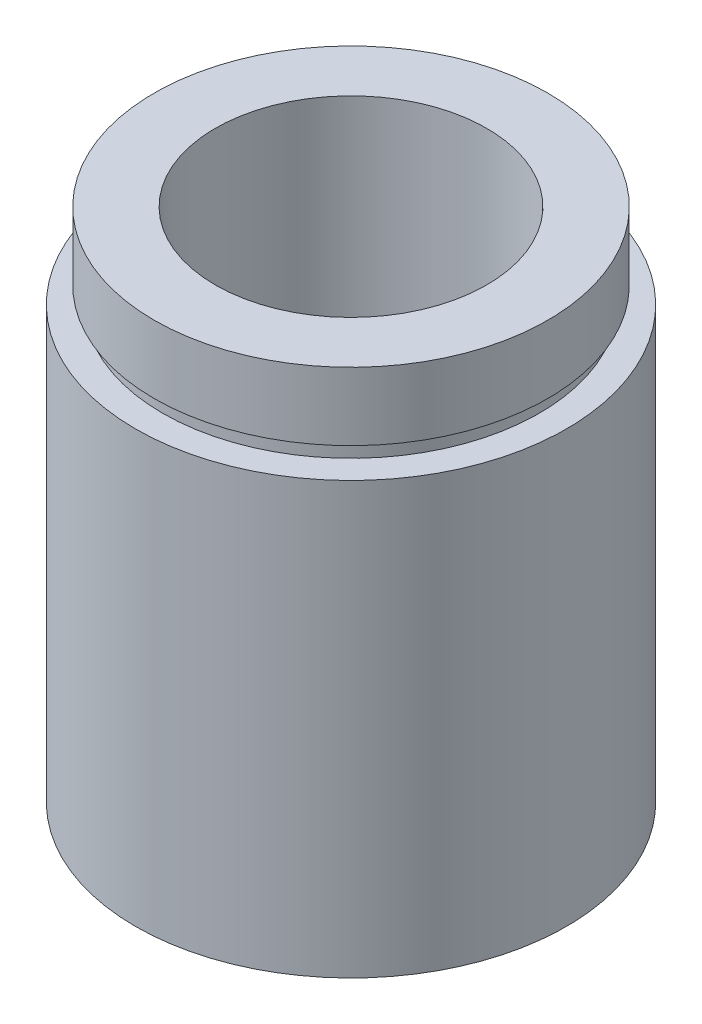
ISO-10303-21;
HEADER;
FILE_DESCRIPTION(('STEP AP214'),'2;1');
FILE_NAME('part.step','',(''),(''),'','','');
FILE_SCHEMA(('AUTOMOTIVE_DESIGN { 1 0 10303 214 1 1 1 1 }'));
ENDSEC;
DATA;
#1=APPLICATION_CONTEXT('core data for automotive mechanical design processes');
#2=APPLICATION_PROTOCOL_DEFINITION('international standard','automotive_design',2000,#1);
#3=PRODUCT_CONTEXT('',#1,'mechanical');
#4=PRODUCT('Part','Part','',(#3));
#5=PRODUCT_RELATED_PRODUCT_CATEGORY('part','',(#4));
#6=PRODUCT_DEFINITION_FORMATION('','',#4);
#7=PRODUCT_DEFINITION_CONTEXT('part definition',#1,'design');
#8=PRODUCT_DEFINITION('design','',#6,#7);
#9=PRODUCT_DEFINITION_SHAPE('','',#8);
#10=(LENGTH_UNIT() NAMED_UNIT(*) SI_UNIT(.MILLI.,.METRE.));
#11=(NAMED_UNIT(*) PLANE_ANGLE_UNIT() SI_UNIT($,.RADIAN.));
#12=(NAMED_UNIT(*) SI_UNIT($,.STERADIAN.) SOLID_ANGLE_UNIT());
#13=UNCERTAINTY_MEASURE_WITH_UNIT(LENGTH_MEASURE(1.E-05),#10,'distance_accuracy_value','');
#14=(GEOMETRIC_REPRESENTATION_CONTEXT(3) GLOBAL_UNCERTAINTY_ASSIGNED_CONTEXT((#13)) GLOBAL_UNIT_ASSIGNED_CONTEXT((#10,
#11,#12)) REPRESENTATION_CONTEXT('',''));
#15=CARTESIAN_POINT('',(0.,0.,0.));
#16=DIRECTION('',(0.,0.,1.));
#17=DIRECTION('',(1.,0.,0.));
#18=AXIS2_PLACEMENT_3D('',#15,#16,#17);
#19=CARTESIAN_POINT('',(11.1,0.,0.));
#20=DIRECTION('',(0.,1.,0.));
#21=DIRECTION('',(0.,0.,1.));
#22=AXIS2_PLACEMENT_3D('',#19,#20,#21);
#23=PLANE('',#22);
#24=CARTESIAN_POINT('',(0.,0.,0.));
#25=DIRECTION('',(0.,1.,0.));
#26=DIRECTION('',(0.,0.,1.));
#27=AXIS2_PLACEMENT_3D('',#24,#25,#26);
#28=CIRCLE('',#27,12.7);
#29=CARTESIAN_POINT('',(0.,0.,12.7));
#30=VERTEX_POINT('',#29);
#31=EDGE_CURVE('E10',#30,#30,#28,.T.);
#32=ORIENTED_EDGE('',*,*,#31,.F.);
#33=EDGE_LOOP('',(#32));
#34=FACE_BOUND('',#33,.T.);
#35=CARTESIAN_POINT('',(0.,0.,0.));
#36=DIRECTION('',(0.,1.,0.));
#37=DIRECTION('',(0.,0.,1.));
#38=AXIS2_PLACEMENT_3D('',#35,#36,#37);
#39=CIRCLE('',#38,11.1);
#40=CARTESIAN_POINT('',(0.,0.,11.1));
#41=VERTEX_POINT('',#40);
#42=EDGE_CURVE('E77',#41,#41,#39,.T.);
#43=ORIENTED_EDGE('',*,*,#42,.T.);
#44=EDGE_LOOP('',(#43));
#45=FACE_BOUND('',#44,.T.);
#46=ADVANCED_FACE('F37',(#34,#45),#23,.F.);
#47=CARTESIAN_POINT('',(0.,161.376166943427,0.));
#48=DIRECTION('',(0.,1.,0.));
#49=DIRECTION('',(0.,0.,1.));
#50=AXIS2_PLACEMENT_3D('',#47,#48,#49);
#51=CYLINDRICAL_SURFACE('',#50,12.7);
#52=CARTESIAN_POINT('',(0.,25.4,0.));
#53=DIRECTION('',(0.,1.,0.));
#54=DIRECTION('',(0.,0.,1.));
#55=AXIS2_PLACEMENT_3D('',#52,#53,#54);
#56=CIRCLE('',#55,12.7);
#57=CARTESIAN_POINT('',(0.,25.4,12.7));
#58=VERTEX_POINT('',#57);
#59=EDGE_CURVE('E43',#58,#58,#56,.T.);
#60=ORIENTED_EDGE('',*,*,#59,.F.);
#61=EDGE_LOOP('',(#60));
#62=FACE_BOUND('',#61,.T.);
#63=ORIENTED_EDGE('',*,*,#31,.T.);
#64=EDGE_LOOP('',(#63));
#65=FACE_BOUND('',#64,.T.);
#66=ADVANCED_FACE('F138',(#62,#65),#51,.T.);
#67=CARTESIAN_POINT('',(12.7,25.4,0.));
#68=DIRECTION('',(0.,-1.,0.));
#69=DIRECTION('',(0.,0.,-1.));
#70=AXIS2_PLACEMENT_3D('',#67,#68,#69);
#71=PLANE('',#70);
#72=CARTESIAN_POINT('',(0.,25.4,0.));
#73=DIRECTION('',(0.,1.,0.));
#74=DIRECTION('',(0.,0.,1.));
#75=AXIS2_PLACEMENT_3D('',#72,#73,#74);
#76=CIRCLE('',#75,11.1);
#77=CARTESIAN_POINT('',(0.,25.4,11.1));
#78=VERTEX_POINT('',#77);
#79=EDGE_CURVE('E47',#78,#78,#76,.T.);
#80=ORIENTED_EDGE('',*,*,#79,.F.);
#81=EDGE_LOOP('',(#80));
#82=FACE_BOUND('',#81,.T.);
#83=ORIENTED_EDGE('',*,*,#59,.T.);
#84=EDGE_LOOP('',(#83));
#85=FACE_BOUND('',#84,.T.);
#86=ADVANCED_FACE('F133',(#82,#85),#71,.F.);
#87=CARTESIAN_POINT('',(0.,161.376166943427,0.));
#88=DIRECTION('',(0.,1.,0.));
#89=DIRECTION('',(0.,0.,1.));
#90=AXIS2_PLACEMENT_3D('',#87,#88,#89);
#91=CYLINDRICAL_SURFACE('',#90,11.1);
#92=CARTESIAN_POINT('',(0.,26.4,0.));
#93=DIRECTION('',(0.,1.,0.));
#94=DIRECTION('',(0.,0.,1.));
#95=AXIS2_PLACEMENT_3D('',#92,#93,#94);
#96=CIRCLE('',#95,11.1);
#97=CARTESIAN_POINT('',(0.,26.4,11.1));
#98=VERTEX_POINT('',#97);
#99=EDGE_CURVE('E51',#98,#98,#96,.T.);
#100=ORIENTED_EDGE('',*,*,#99,.F.);
#101=EDGE_LOOP('',(#100));
#102=FACE_BOUND('',#101,.T.);
#103=ORIENTED_EDGE('',*,*,#79,.T.);
#104=EDGE_LOOP('',(#103));
#105=FACE_BOUND('',#104,.T.);
#106=ADVANCED_FACE('F127',(#102,#105),#91,.T.);
#107=CARTESIAN_POINT('',(11.1,26.4,0.));
#108=DIRECTION('',(0.,1.,0.));
#109=DIRECTION('',(0.,0.,1.));
#110=AXIS2_PLACEMENT_3D('',#107,#108,#109);
#111=PLANE('',#110);
#112=CARTESIAN_POINT('',(0.,26.4,0.));
#113=DIRECTION('',(0.,1.,0.));
#114=DIRECTION('',(0.,0.,1.));
#115=AXIS2_PLACEMENT_3D('',#112,#113,#114);
#116=CIRCLE('',#115,11.6);
#117=CARTESIAN_POINT('',(0.,26.4,11.6));
#118=VERTEX_POINT('',#117);
#119=EDGE_CURVE('E56',#118,#118,#116,.T.);
#120=ORIENTED_EDGE('',*,*,#119,.F.);
#121=EDGE_LOOP('',(#120));
#122=FACE_BOUND('',#121,.T.);
#123=ORIENTED_EDGE('',*,*,#99,.T.);
#124=EDGE_LOOP('',(#123));
#125=FACE_BOUND('',#124,.T.);
#126=ADVANCED_FACE('F121',(#122,#125),#111,.F.);
#127=CARTESIAN_POINT('',(0.,161.376166943427,0.));
#128=DIRECTION('',(0.,1.,0.));
#129=DIRECTION('',(0.,0.,1.));
#130=AXIS2_PLACEMENT_3D('',#127,#128,#129);
#131=CYLINDRICAL_SURFACE('',#130,11.6);
#132=CARTESIAN_POINT('',(0.,30.4,0.));
#133=DIRECTION('',(0.,1.,0.));
#134=DIRECTION('',(0.,0.,1.));
#135=AXIS2_PLACEMENT_3D('',#132,#133,#134);
#136=CIRCLE('',#135,11.6);
#137=CARTESIAN_POINT('',(0.,30.4,11.6));
#138=VERTEX_POINT('',#137);
#139=EDGE_CURVE('E59',#138,#138,#136,.T.);
#140=ORIENTED_EDGE('',*,*,#139,.F.);
#141=EDGE_LOOP('',(#140));
#142=FACE_BOUND('',#141,.T.);
#143=ORIENTED_EDGE('',*,*,#119,.T.);
#144=EDGE_LOOP('',(#143));
#145=FACE_BOUND('',#144,.T.);
#146=ADVANCED_FACE('F115',(#142,#145),#131,.T.);
#147=CARTESIAN_POINT('',(11.6,30.4,0.));
#148=DIRECTION('',(0.,-1.,0.));
#149=DIRECTION('',(0.,0.,-1.));
#150=AXIS2_PLACEMENT_3D('',#147,#148,#149);
#151=PLANE('',#150);
#152=CARTESIAN_POINT('',(0.,30.4,0.));
#153=DIRECTION('',(0.,1.,0.));
#154=DIRECTION('',(0.,0.,1.));
#155=AXIS2_PLACEMENT_3D('',#152,#153,#154);
#156=CIRCLE('',#155,8.00000000000002);
#157=CARTESIAN_POINT('',(0.,30.4,8.00000000000002));
#158=VERTEX_POINT('',#157);
#159=EDGE_CURVE('E62',#158,#158,#156,.T.);
#160=ORIENTED_EDGE('',*,*,#159,.F.);
#161=EDGE_LOOP('',(#160));
#162=FACE_BOUND('',#161,.T.);
#163=ORIENTED_EDGE('',*,*,#139,.T.);
#164=EDGE_LOOP('',(#163));
#165=FACE_BOUND('',#164,.T.);
#166=ADVANCED_FACE('F109',(#162,#165),#151,.F.);
#167=CARTESIAN_POINT('',(0.,161.376166943427,0.));
#168=DIRECTION('',(0.,1.,0.));
#169=DIRECTION('',(0.,0.,1.));
#170=AXIS2_PLACEMENT_3D('',#167,#168,#169);
#171=CYLINDRICAL_SURFACE('',#170,8.00000000000002);
#172=CARTESIAN_POINT('',(0.,5.49999999999998,0.));
#173=DIRECTION('',(0.,1.,0.));
#174=DIRECTION('',(0.,0.,1.));
#175=AXIS2_PLACEMENT_3D('',#172,#173,#174);
#176=CIRCLE('',#175,8.00000000000002);
#177=CARTESIAN_POINT('',(0.,5.49999999999998,8.00000000000002));
#178=VERTEX_POINT('',#177);
#179=EDGE_CURVE('E65',#178,#178,#176,.T.);
#180=ORIENTED_EDGE('',*,*,#179,.F.);
#181=EDGE_LOOP('',(#180));
#182=FACE_BOUND('',#181,.T.);
#183=ORIENTED_EDGE('',*,*,#159,.T.);
#184=EDGE_LOOP('',(#183));
#185=FACE_BOUND('',#184,.T.);
#186=ADVANCED_FACE('F103',(#182,#185),#171,.F.);
#187=CARTESIAN_POINT('',(11.7,5.49999999999998,0.));
#188=DIRECTION('',(0.,1.,0.));
#189=DIRECTION('',(0.,0.,1.));
#190=AXIS2_PLACEMENT_3D('',#187,#188,#189);
#191=PLANE('',#190);
#192=CARTESIAN_POINT('',(0.,5.49999999999998,0.));
#193=DIRECTION('',(0.,1.,0.));
#194=DIRECTION('',(0.,0.,1.));
#195=AXIS2_PLACEMENT_3D('',#192,#193,#194);
#196=CIRCLE('',#195,11.7);
#197=CARTESIAN_POINT('',(0.,5.49999999999998,11.7));
#198=VERTEX_POINT('',#197);
#199=EDGE_CURVE('E68',#198,#198,#196,.T.);
#200=ORIENTED_EDGE('',*,*,#199,.F.);
#201=EDGE_LOOP('',(#200));
#202=FACE_BOUND('',#201,.T.);
#203=ORIENTED_EDGE('',*,*,#179,.T.);
#204=EDGE_LOOP('',(#203));
#205=FACE_BOUND('',#204,.T.);
#206=ADVANCED_FACE('F97',(#202,#205),#191,.F.);
#207=CARTESIAN_POINT('',(0.,161.376166943427,0.));
#208=DIRECTION('',(0.,1.,0.));
#209=DIRECTION('',(0.,0.,1.));
#210=AXIS2_PLACEMENT_3D('',#207,#208,#209);
#211=CYLINDRICAL_SURFACE('',#210,11.7);
#212=CARTESIAN_POINT('',(0.,4.49999999999998,0.));
#213=DIRECTION('',(0.,1.,0.));
#214=DIRECTION('',(0.,0.,1.));
#215=AXIS2_PLACEMENT_3D('',#212,#213,#214);
#216=CIRCLE('',#215,11.7);
#217=CARTESIAN_POINT('',(0.,4.49999999999998,11.7));
#218=VERTEX_POINT('',#217);
#219=EDGE_CURVE('E71',#218,#218,#216,.T.);
#220=ORIENTED_EDGE('',*,*,#219,.F.);
#221=EDGE_LOOP('',(#220));
#222=FACE_BOUND('',#221,.T.);
#223=ORIENTED_EDGE('',*,*,#199,.T.);
#224=EDGE_LOOP('',(#223));
#225=FACE_BOUND('',#224,.T.);
#226=ADVANCED_FACE('F91',(#222,#225),#211,.F.);
#227=CARTESIAN_POINT('',(11.1,4.49999999999998,0.));
#228=DIRECTION('',(0.,-1.,0.));
#229=DIRECTION('',(0.,0.,-1.));
#230=AXIS2_PLACEMENT_3D('',#227,#228,#229);
#231=PLANE('',#230);
#232=CARTESIAN_POINT('',(0.,4.49999999999998,0.));
#233=DIRECTION('',(0.,1.,0.));
#234=DIRECTION('',(0.,0.,1.));
#235=AXIS2_PLACEMENT_3D('',#232,#233,#234);
#236=CIRCLE('',#235,11.1);
#237=CARTESIAN_POINT('',(0.,4.49999999999998,11.1));
#238=VERTEX_POINT('',#237);
#239=EDGE_CURVE('E74',#238,#238,#236,.T.);
#240=ORIENTED_EDGE('',*,*,#239,.F.);
#241=EDGE_LOOP('',(#240));
#242=FACE_BOUND('',#241,.T.);
#243=ORIENTED_EDGE('',*,*,#219,.T.);
#244=EDGE_LOOP('',(#243));
#245=FACE_BOUND('',#244,.T.);
#246=ADVANCED_FACE('F85',(#242,#245),#231,.F.);
#247=CARTESIAN_POINT('',(0.,161.376166943427,0.));
#248=DIRECTION('',(0.,1.,0.));
#249=DIRECTION('',(0.,0.,1.));
#250=AXIS2_PLACEMENT_3D('',#247,#248,#249);
#251=CYLINDRICAL_SURFACE('',#250,11.1);
#252=ORIENTED_EDGE('',*,*,#42,.F.);
#253=EDGE_LOOP('',(#252));
#254=FACE_BOUND('',#253,.T.);
#255=ORIENTED_EDGE('',*,*,#239,.T.);
#256=EDGE_LOOP('',(#255));
#257=FACE_BOUND('',#256,.T.);
#258=ADVANCED_FACE('F82',(#254,#257),#251,.F.);
#259=CLOSED_SHELL('',(#46,#66,#86,#106,#126,#146,#166,#186,#206,#226,#246,#258));
#260=MANIFOLD_SOLID_BREP('B2',#259);
#261=ADVANCED_BREP_SHAPE_REPRESENTATION('',(#18,#260),#14);
#262=SHAPE_DEFINITION_REPRESENTATION(#9,#261);
ENDSEC;
END-ISO-10303-21;
